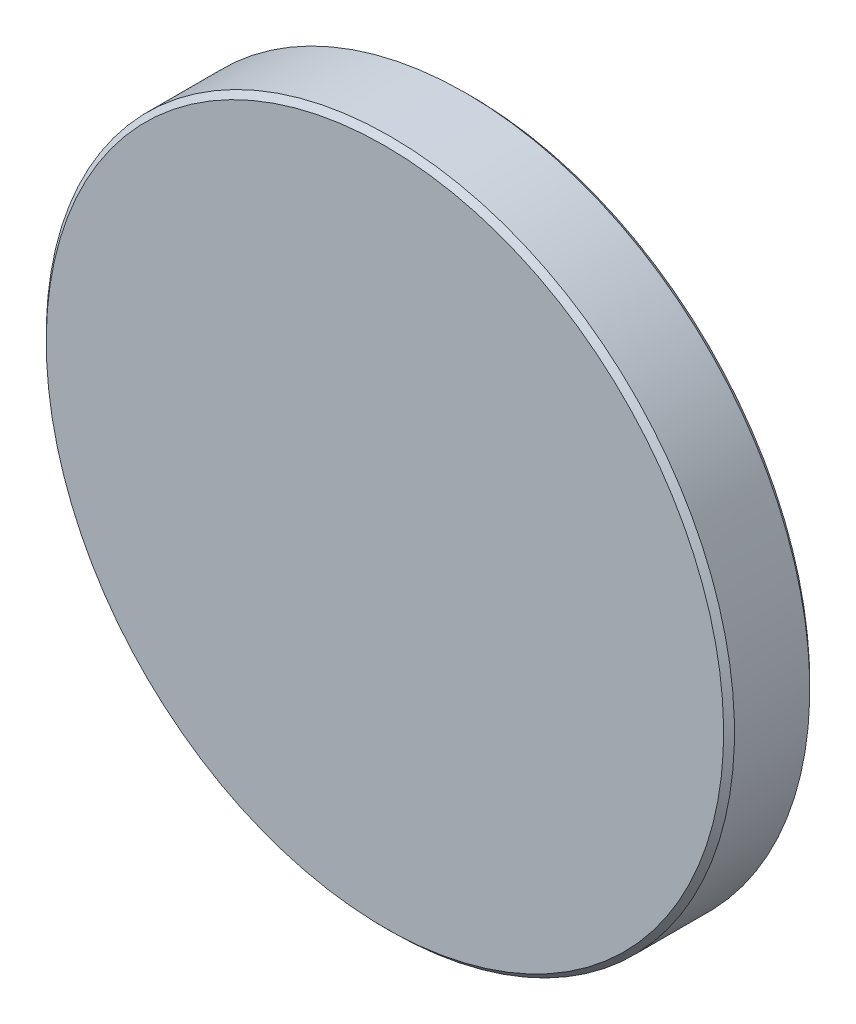
ISO-10303-21;
HEADER;
FILE_DESCRIPTION(('STEP AP214'),'2;1');
FILE_NAME('part.step','',(''),(''),'','','');
FILE_SCHEMA(('AUTOMOTIVE_DESIGN { 1 0 10303 214 1 1 1 1 }'));
ENDSEC;
DATA;
#1=APPLICATION_CONTEXT('core data for automotive mechanical design processes');
#2=APPLICATION_PROTOCOL_DEFINITION('international standard','automotive_design',2000,#1);
#3=PRODUCT_CONTEXT('',#1,'mechanical');
#4=PRODUCT('Part','Part','',(#3));
#5=PRODUCT_RELATED_PRODUCT_CATEGORY('part','',(#4));
#6=PRODUCT_DEFINITION_FORMATION('','',#4);
#7=PRODUCT_DEFINITION_CONTEXT('part definition',#1,'design');
#8=PRODUCT_DEFINITION('design','',#6,#7);
#9=PRODUCT_DEFINITION_SHAPE('','',#8);
#10=(LENGTH_UNIT() NAMED_UNIT(*) SI_UNIT(.MILLI.,.METRE.));
#11=(NAMED_UNIT(*) PLANE_ANGLE_UNIT() SI_UNIT($,.RADIAN.));
#12=(NAMED_UNIT(*) SI_UNIT($,.STERADIAN.) SOLID_ANGLE_UNIT());
#13=UNCERTAINTY_MEASURE_WITH_UNIT(LENGTH_MEASURE(1.E-05),#10,'distance_accuracy_value','');
#14=(GEOMETRIC_REPRESENTATION_CONTEXT(3) GLOBAL_UNCERTAINTY_ASSIGNED_CONTEXT((#13)) GLOBAL_UNIT_ASSIGNED_CONTEXT((#10,
#11,#12)) REPRESENTATION_CONTEXT('',''));
#15=CARTESIAN_POINT('',(0.,0.,0.));
#16=DIRECTION('',(0.,0.,1.));
#17=DIRECTION('',(1.,0.,0.));
#18=AXIS2_PLACEMENT_3D('',#15,#16,#17);
#19=CARTESIAN_POINT('',(0.,54.,458.414283312411));
#20=DIRECTION('',(0.,0.,-1.));
#21=DIRECTION('',(0.,1.,0.));
#22=AXIS2_PLACEMENT_3D('',#19,#20,#21);
#23=PLANE('',#22);
#24=CARTESIAN_POINT('',(0.,0.,458.414283312411));
#25=DIRECTION('',(0.,0.,-1.));
#26=DIRECTION('',(0.,1.,0.));
#27=AXIS2_PLACEMENT_3D('',#24,#25,#26);
#28=CIRCLE('',#27,62.3349);
#29=CARTESIAN_POINT('',(0.,62.3349,458.414283312411));
#30=VERTEX_POINT('',#29);
#31=EDGE_CURVE('E10',#30,#30,#28,.F.);
#32=ORIENTED_EDGE('',*,*,#31,.T.);
#33=EDGE_LOOP('',(#32));
#34=FACE_BOUND('',#33,.T.);
#35=ADVANCED_FACE('F35',(#34),#23,.F.);
#36=CARTESIAN_POINT('',(0.,0.,662.018));
#37=DIRECTION('',(0.,0.,1.));
#38=DIRECTION('',(0.,-1.,0.));
#39=AXIS2_PLACEMENT_3D('',#36,#37,#38);
#40=CYLINDRICAL_SURFACE('',#39,63.3349);
#41=CARTESIAN_POINT('',(0.,0.,443.555821638463));
#42=DIRECTION('',(0.,0.,1.));
#43=DIRECTION('',(0.,-1.,0.));
#44=AXIS2_PLACEMENT_3D('',#41,#42,#43);
#45=CIRCLE('',#44,63.3349);
#46=CARTESIAN_POINT('',(0.,-63.3348999999999,443.555821638463));
#47=VERTEX_POINT('',#46);
#48=EDGE_CURVE('E46',#47,#47,#45,.T.);
#49=ORIENTED_EDGE('',*,*,#48,.T.);
#50=EDGE_LOOP('',(#49));
#51=FACE_BOUND('',#50,.T.);
#52=CARTESIAN_POINT('',(0.,0.,457.414283312411));
#53=DIRECTION('',(0.,0.,-1.));
#54=DIRECTION('',(0.,1.,0.));
#55=AXIS2_PLACEMENT_3D('',#52,#53,#54);
#56=CIRCLE('',#55,63.3349);
#57=CARTESIAN_POINT('',(0.,63.3349,457.414283312411));
#58=VERTEX_POINT('',#57);
#59=EDGE_CURVE('E50',#58,#58,#56,.T.);
#60=ORIENTED_EDGE('',*,*,#59,.T.);
#61=EDGE_LOOP('',(#60));
#62=FACE_BOUND('',#61,.T.);
#63=ADVANCED_FACE('F56',(#51,#62),#40,.T.);
#64=CARTESIAN_POINT('',(0.,63.3349,442.555821638463));
#65=DIRECTION('',(0.,0.,1.));
#66=DIRECTION('',(0.,-1.,0.));
#67=AXIS2_PLACEMENT_3D('',#64,#65,#66);
#68=PLANE('',#67);
#69=CARTESIAN_POINT('',(0.,0.,442.555821638463));
#70=DIRECTION('',(0.,0.,1.));
#71=DIRECTION('',(0.,-1.,0.));
#72=AXIS2_PLACEMENT_3D('',#69,#70,#71);
#73=CIRCLE('',#72,62.3348999999999);
#74=CARTESIAN_POINT('',(0.,-62.3348999999999,442.555821638463));
#75=VERTEX_POINT('',#74);
#76=EDGE_CURVE('E42',#75,#75,#73,.F.);
#77=ORIENTED_EDGE('',*,*,#76,.T.);
#78=EDGE_LOOP('',(#77));
#79=FACE_BOUND('',#78,.T.);
#80=ADVANCED_FACE('F64',(#79),#68,.F.);
#81=CARTESIAN_POINT('',(0.,0.,443.555821638463));
#82=DIRECTION('',(0.,0.,1.));
#83=DIRECTION('',(0.,-1.,0.));
#84=AXIS2_PLACEMENT_3D('',#81,#82,#83);
#85=CONICAL_SURFACE('',#84,63.3349,0.785398163397448);
#86=ORIENTED_EDGE('',*,*,#76,.F.);
#87=EDGE_LOOP('',(#86));
#88=FACE_BOUND('',#87,.T.);
#89=ORIENTED_EDGE('',*,*,#48,.F.);
#90=EDGE_LOOP('',(#89));
#91=FACE_BOUND('',#90,.T.);
#92=ADVANCED_FACE('F60',(#88,#91),#85,.T.);
#93=CARTESIAN_POINT('',(0.,0.,458.414283312411));
#94=DIRECTION('',(0.,0.,-1.));
#95=DIRECTION('',(0.,1.,0.));
#96=AXIS2_PLACEMENT_3D('',#93,#94,#95);
#97=CONICAL_SURFACE('',#96,62.3349,0.785398163397421);
#98=ORIENTED_EDGE('',*,*,#59,.F.);
#99=EDGE_LOOP('',(#98));
#100=FACE_BOUND('',#99,.T.);
#101=ORIENTED_EDGE('',*,*,#31,.F.);
#102=EDGE_LOOP('',(#101));
#103=FACE_BOUND('',#102,.T.);
#104=ADVANCED_FACE('F37',(#100,#103),#97,.T.);
#105=CLOSED_SHELL('',(#35,#63,#80,#92,#104));
#106=MANIFOLD_SOLID_BREP('B2',#105);
#107=ADVANCED_BREP_SHAPE_REPRESENTATION('',(#18,#106),#14);
#108=SHAPE_DEFINITION_REPRESENTATION(#9,#107);
ENDSEC;
END-ISO-10303-21;
